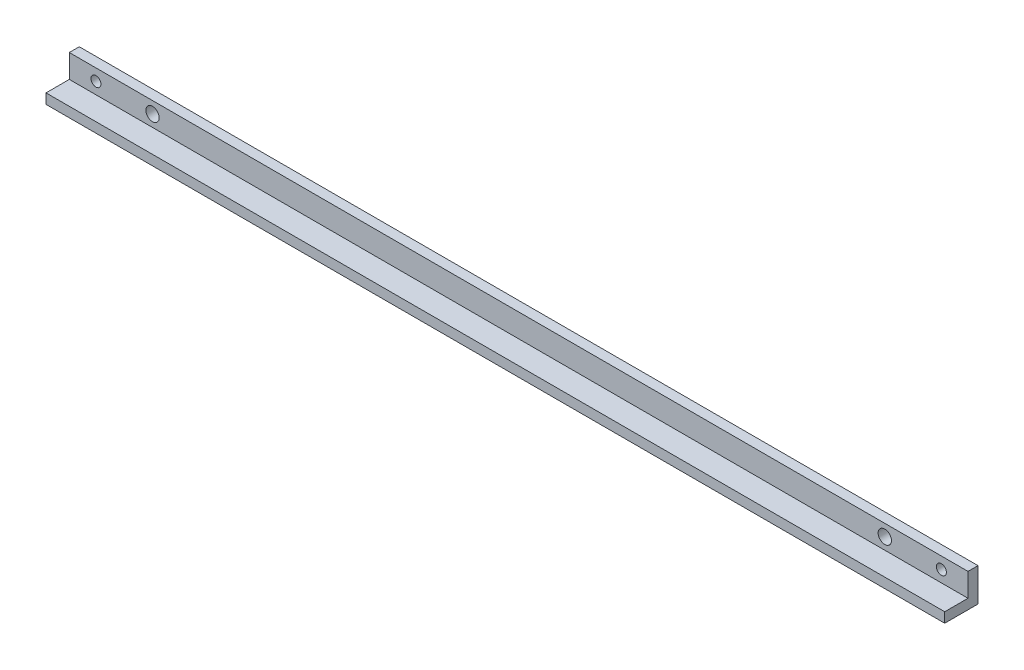
ISO-10303-21;
HEADER;
FILE_DESCRIPTION(('STEP AP214'),'2;1');
FILE_NAME('part.step','',(''),(''),'','','');
FILE_SCHEMA(('AUTOMOTIVE_DESIGN { 1 0 10303 214 1 1 1 1 }'));
ENDSEC;
DATA;
#1=APPLICATION_CONTEXT('core data for automotive mechanical design processes');
#2=APPLICATION_PROTOCOL_DEFINITION('international standard','automotive_design',2000,#1);
#3=PRODUCT_CONTEXT('',#1,'mechanical');
#4=PRODUCT('Part','Part','',(#3));
#5=PRODUCT_RELATED_PRODUCT_CATEGORY('part','',(#4));
#6=PRODUCT_DEFINITION_FORMATION('','',#4);
#7=PRODUCT_DEFINITION_CONTEXT('part definition',#1,'design');
#8=PRODUCT_DEFINITION('design','',#6,#7);
#9=PRODUCT_DEFINITION_SHAPE('','',#8);
#10=(LENGTH_UNIT() NAMED_UNIT(*) SI_UNIT(.MILLI.,.METRE.));
#11=(NAMED_UNIT(*) PLANE_ANGLE_UNIT() SI_UNIT($,.RADIAN.));
#12=(NAMED_UNIT(*) SI_UNIT($,.STERADIAN.) SOLID_ANGLE_UNIT());
#13=UNCERTAINTY_MEASURE_WITH_UNIT(LENGTH_MEASURE(1.E-05),#10,'distance_accuracy_value','');
#14=(GEOMETRIC_REPRESENTATION_CONTEXT(3) GLOBAL_UNCERTAINTY_ASSIGNED_CONTEXT((#13)) GLOBAL_UNIT_ASSIGNED_CONTEXT((#10,
#11,#12)) REPRESENTATION_CONTEXT('',''));
#15=CARTESIAN_POINT('',(0.,0.,0.));
#16=DIRECTION('',(0.,0.,1.));
#17=DIRECTION('',(1.,0.,0.));
#18=AXIS2_PLACEMENT_3D('',#15,#16,#17);
#19=CARTESIAN_POINT('',(270.,10.,0.));
#20=DIRECTION('',(0.,0.,1.));
#21=DIRECTION('',(0.,-1.,0.));
#22=AXIS2_PLACEMENT_3D('',#19,#20,#21);
#23=PLANE('',#22);
#24=CARTESIAN_POINT('',(262.,6.5,0.));
#25=DIRECTION('',(0.,0.,1.));
#26=DIRECTION('',(-1.,0.,0.));
#27=AXIS2_PLACEMENT_3D('',#24,#25,#26);
#28=CIRCLE('',#27,1.50000000000002);
#29=CARTESIAN_POINT('',(260.5,6.5,0.));
#30=VERTEX_POINT('',#29);
#31=EDGE_CURVE('E164',#30,#30,#28,.T.);
#32=ORIENTED_EDGE('',*,*,#31,.T.);
#33=EDGE_LOOP('',(#32));
#34=FACE_BOUND('',#33,.T.);
#35=CARTESIAN_POINT('',(8.,6.5,0.));
#36=DIRECTION('',(0.,0.,1.));
#37=DIRECTION('',(1.,0.,0.));
#38=AXIS2_PLACEMENT_3D('',#35,#36,#37);
#39=CIRCLE('',#38,1.5);
#40=CARTESIAN_POINT('',(9.5,6.5,0.));
#41=VERTEX_POINT('',#40);
#42=EDGE_CURVE('E168',#41,#41,#39,.T.);
#43=ORIENTED_EDGE('',*,*,#42,.T.);
#44=EDGE_LOOP('',(#43));
#45=FACE_BOUND('',#44,.T.);
#46=CARTESIAN_POINT('',(245.,6.50000000000003,0.));
#47=DIRECTION('',(0.,0.,1.));
#48=DIRECTION('',(-1.,0.,0.));
#49=AXIS2_PLACEMENT_3D('',#46,#47,#48);
#50=CIRCLE('',#49,2.00000000000003);
#51=CARTESIAN_POINT('',(243.,6.50000000000003,0.));
#52=VERTEX_POINT('',#51);
#53=EDGE_CURVE('E172',#52,#52,#50,.T.);
#54=ORIENTED_EDGE('',*,*,#53,.T.);
#55=EDGE_LOOP('',(#54));
#56=FACE_BOUND('',#55,.T.);
#57=CARTESIAN_POINT('',(25.,6.5,0.));
#58=DIRECTION('',(0.,0.,1.));
#59=DIRECTION('',(1.,0.,0.));
#60=AXIS2_PLACEMENT_3D('',#57,#58,#59);
#61=CIRCLE('',#60,2.);
#62=CARTESIAN_POINT('',(27.,6.5,0.));
#63=VERTEX_POINT('',#62);
#64=EDGE_CURVE('E123',#63,#63,#61,.T.);
#65=ORIENTED_EDGE('',*,*,#64,.T.);
#66=EDGE_LOOP('',(#65));
#67=FACE_BOUND('',#66,.T.);
#68=DIRECTION('',(0.,1.,0.));
#69=VECTOR('',#68,1.);
#70=CARTESIAN_POINT('',(0.,10.,0.));
#71=LINE('',#70,#69);
#72=CARTESIAN_POINT('',(0.,0.,0.));
#73=VERTEX_POINT('',#72);
#74=CARTESIAN_POINT('',(0.,10.,0.));
#75=VERTEX_POINT('',#74);
#76=EDGE_CURVE('E119',#73,#75,#71,.T.);
#77=ORIENTED_EDGE('',*,*,#76,.T.);
#78=DIRECTION('',(-1.,0.,0.));
#79=VECTOR('',#78,1.);
#80=CARTESIAN_POINT('',(270.,10.,0.));
#81=LINE('',#80,#79);
#82=CARTESIAN_POINT('',(270.,10.,0.));
#83=VERTEX_POINT('',#82);
#84=EDGE_CURVE('E11',#83,#75,#81,.T.);
#85=ORIENTED_EDGE('',*,*,#84,.F.);
#86=DIRECTION('',(0.,1.,0.));
#87=VECTOR('',#86,1.);
#88=CARTESIAN_POINT('',(270.,10.,0.));
#89=LINE('',#88,#87);
#90=CARTESIAN_POINT('',(270.,0.,0.));
#91=VERTEX_POINT('',#90);
#92=EDGE_CURVE('E130',#91,#83,#89,.T.);
#93=ORIENTED_EDGE('',*,*,#92,.F.);
#94=DIRECTION('',(-1.,0.,0.));
#95=VECTOR('',#94,1.);
#96=CARTESIAN_POINT('',(270.,0.,0.));
#97=LINE('',#96,#95);
#98=EDGE_CURVE('E115',#91,#73,#97,.T.);
#99=ORIENTED_EDGE('',*,*,#98,.T.);
#100=EDGE_LOOP('',(#77,#85,#93,#99));
#101=FACE_BOUND('',#100,.T.);
#102=ADVANCED_FACE('F35',(#34,#45,#56,#67,#101),#23,.F.);
#103=CARTESIAN_POINT('',(270.,10.,3.));
#104=DIRECTION('',(0.,-1.,0.));
#105=DIRECTION('',(0.,0.,-1.));
#106=AXIS2_PLACEMENT_3D('',#103,#104,#105);
#107=PLANE('',#106);
#108=DIRECTION('',(0.,0.,1.));
#109=VECTOR('',#108,1.);
#110=CARTESIAN_POINT('',(0.,10.,3.));
#111=LINE('',#110,#109);
#112=CARTESIAN_POINT('',(0.,10.,3.));
#113=VERTEX_POINT('',#112);
#114=EDGE_CURVE('E122',#75,#113,#111,.T.);
#115=ORIENTED_EDGE('',*,*,#114,.T.);
#116=DIRECTION('',(-1.,0.,0.));
#117=VECTOR('',#116,1.);
#118=CARTESIAN_POINT('',(270.,10.,3.));
#119=LINE('',#118,#117);
#120=CARTESIAN_POINT('',(270.,10.,3.));
#121=VERTEX_POINT('',#120);
#122=EDGE_CURVE('E43',#121,#113,#119,.T.);
#123=ORIENTED_EDGE('',*,*,#122,.F.);
#124=DIRECTION('',(0.,0.,1.));
#125=VECTOR('',#124,1.);
#126=CARTESIAN_POINT('',(270.,10.,3.));
#127=LINE('',#126,#125);
#128=EDGE_CURVE('E88',#83,#121,#127,.T.);
#129=ORIENTED_EDGE('',*,*,#128,.F.);
#130=ORIENTED_EDGE('',*,*,#84,.T.);
#131=EDGE_LOOP('',(#115,#123,#129,#130));
#132=FACE_BOUND('',#131,.T.);
#133=ADVANCED_FACE('F154',(#132),#107,.F.);
#134=CARTESIAN_POINT('',(270.,10.,3.));
#135=DIRECTION('',(0.,0.,-1.));
#136=DIRECTION('',(0.,1.,0.));
#137=AXIS2_PLACEMENT_3D('',#134,#135,#136);
#138=PLANE('',#137);
#139=CARTESIAN_POINT('',(262.,6.5,3.));
#140=DIRECTION('',(0.,0.,1.));
#141=DIRECTION('',(-1.,0.,0.));
#142=AXIS2_PLACEMENT_3D('',#139,#140,#141);
#143=CIRCLE('',#142,1.50000000000002);
#144=CARTESIAN_POINT('',(260.5,6.5,3.));
#145=VERTEX_POINT('',#144);
#146=EDGE_CURVE('E191',#145,#145,#143,.T.);
#147=ORIENTED_EDGE('',*,*,#146,.F.);
#148=EDGE_LOOP('',(#147));
#149=FACE_BOUND('',#148,.T.);
#150=CARTESIAN_POINT('',(8.,6.5,3.));
#151=DIRECTION('',(0.,0.,1.));
#152=DIRECTION('',(1.,0.,0.));
#153=AXIS2_PLACEMENT_3D('',#150,#151,#152);
#154=CIRCLE('',#153,1.5);
#155=CARTESIAN_POINT('',(9.5,6.5,3.));
#156=VERTEX_POINT('',#155);
#157=EDGE_CURVE('E187',#156,#156,#154,.T.);
#158=ORIENTED_EDGE('',*,*,#157,.F.);
#159=EDGE_LOOP('',(#158));
#160=FACE_BOUND('',#159,.T.);
#161=CARTESIAN_POINT('',(245.,6.50000000000003,3.));
#162=DIRECTION('',(0.,0.,1.));
#163=DIRECTION('',(-1.,0.,0.));
#164=AXIS2_PLACEMENT_3D('',#161,#162,#163);
#165=CIRCLE('',#164,2.00000000000003);
#166=CARTESIAN_POINT('',(243.,6.50000000000003,3.));
#167=VERTEX_POINT('',#166);
#168=EDGE_CURVE('E181',#167,#167,#165,.T.);
#169=ORIENTED_EDGE('',*,*,#168,.F.);
#170=EDGE_LOOP('',(#169));
#171=FACE_BOUND('',#170,.T.);
#172=CARTESIAN_POINT('',(25.,6.5,3.));
#173=DIRECTION('',(0.,0.,1.));
#174=DIRECTION('',(1.,0.,0.));
#175=AXIS2_PLACEMENT_3D('',#172,#173,#174);
#176=CIRCLE('',#175,2.);
#177=CARTESIAN_POINT('',(27.,6.5,3.));
#178=VERTEX_POINT('',#177);
#179=EDGE_CURVE('E176',#178,#178,#176,.T.);
#180=ORIENTED_EDGE('',*,*,#179,.F.);
#181=EDGE_LOOP('',(#180));
#182=FACE_BOUND('',#181,.T.);
#183=DIRECTION('',(0.,-1.,0.));
#184=VECTOR('',#183,1.);
#185=CARTESIAN_POINT('',(0.,10.,3.));
#186=LINE('',#185,#184);
#187=CARTESIAN_POINT('',(0.,3.,3.));
#188=VERTEX_POINT('',#187);
#189=EDGE_CURVE('E125',#113,#188,#186,.T.);
#190=ORIENTED_EDGE('',*,*,#189,.T.);
#191=DIRECTION('',(-1.,0.,0.));
#192=VECTOR('',#191,1.);
#193=CARTESIAN_POINT('',(270.,3.,3.));
#194=LINE('',#193,#192);
#195=CARTESIAN_POINT('',(270.,3.,3.));
#196=VERTEX_POINT('',#195);
#197=EDGE_CURVE('E110',#196,#188,#194,.T.);
#198=ORIENTED_EDGE('',*,*,#197,.F.);
#199=DIRECTION('',(0.,-1.,0.));
#200=VECTOR('',#199,1.);
#201=CARTESIAN_POINT('',(270.,10.,3.));
#202=LINE('',#201,#200);
#203=EDGE_CURVE('E101',#121,#196,#202,.T.);
#204=ORIENTED_EDGE('',*,*,#203,.F.);
#205=ORIENTED_EDGE('',*,*,#122,.T.);
#206=EDGE_LOOP('',(#190,#198,#204,#205));
#207=FACE_BOUND('',#206,.T.);
#208=ADVANCED_FACE('F136',(#149,#160,#171,#182,#207),#138,.F.);
#209=CARTESIAN_POINT('',(270.,3.,10.));
#210=DIRECTION('',(0.,-1.,0.));
#211=DIRECTION('',(0.,0.,-1.));
#212=AXIS2_PLACEMENT_3D('',#209,#210,#211);
#213=PLANE('',#212);
#214=DIRECTION('',(0.,0.,1.));
#215=VECTOR('',#214,1.);
#216=CARTESIAN_POINT('',(0.,3.,10.));
#217=LINE('',#216,#215);
#218=CARTESIAN_POINT('',(0.,3.,10.));
#219=VERTEX_POINT('',#218);
#220=EDGE_CURVE('E109',#188,#219,#217,.T.);
#221=ORIENTED_EDGE('',*,*,#220,.T.);
#222=DIRECTION('',(-1.,0.,0.));
#223=VECTOR('',#222,1.);
#224=CARTESIAN_POINT('',(270.,3.,10.));
#225=LINE('',#224,#223);
#226=CARTESIAN_POINT('',(270.,3.,10.));
#227=VERTEX_POINT('',#226);
#228=EDGE_CURVE('E106',#227,#219,#225,.T.);
#229=ORIENTED_EDGE('',*,*,#228,.F.);
#230=DIRECTION('',(0.,0.,1.));
#231=VECTOR('',#230,1.);
#232=CARTESIAN_POINT('',(270.,3.,10.));
#233=LINE('',#232,#231);
#234=EDGE_CURVE('E95',#196,#227,#233,.T.);
#235=ORIENTED_EDGE('',*,*,#234,.F.);
#236=ORIENTED_EDGE('',*,*,#197,.T.);
#237=EDGE_LOOP('',(#221,#229,#235,#236));
#238=FACE_BOUND('',#237,.T.);
#239=ADVANCED_FACE('F107',(#238),#213,.F.);
#240=CARTESIAN_POINT('',(270.,0.,10.));
#241=DIRECTION('',(0.,0.,-1.));
#242=DIRECTION('',(-1.,0.,0.));
#243=AXIS2_PLACEMENT_3D('',#240,#241,#242);
#244=PLANE('',#243);
#245=DIRECTION('',(0.,-1.,0.));
#246=VECTOR('',#245,1.);
#247=CARTESIAN_POINT('',(0.,0.,10.));
#248=LINE('',#247,#246);
#249=CARTESIAN_POINT('',(0.,0.,10.));
#250=VERTEX_POINT('',#249);
#251=EDGE_CURVE('E74',#219,#250,#248,.T.);
#252=ORIENTED_EDGE('',*,*,#251,.T.);
#253=DIRECTION('',(-1.,0.,0.));
#254=VECTOR('',#253,1.);
#255=CARTESIAN_POINT('',(270.,0.,10.));
#256=LINE('',#255,#254);
#257=CARTESIAN_POINT('',(270.,0.,10.));
#258=VERTEX_POINT('',#257);
#259=EDGE_CURVE('E111',#258,#250,#256,.T.);
#260=ORIENTED_EDGE('',*,*,#259,.F.);
#261=DIRECTION('',(0.,-1.,0.));
#262=VECTOR('',#261,1.);
#263=CARTESIAN_POINT('',(270.,0.,10.));
#264=LINE('',#263,#262);
#265=EDGE_CURVE('E99',#227,#258,#264,.T.);
#266=ORIENTED_EDGE('',*,*,#265,.F.);
#267=ORIENTED_EDGE('',*,*,#228,.T.);
#268=EDGE_LOOP('',(#252,#260,#266,#267));
#269=FACE_BOUND('',#268,.T.);
#270=ADVANCED_FACE('F113',(#269),#244,.F.);
#271=CARTESIAN_POINT('',(270.,0.,0.));
#272=DIRECTION('',(0.,1.,0.));
#273=DIRECTION('',(0.,0.,1.));
#274=AXIS2_PLACEMENT_3D('',#271,#272,#273);
#275=PLANE('',#274);
#276=DIRECTION('',(0.,0.,-1.));
#277=VECTOR('',#276,1.);
#278=CARTESIAN_POINT('',(0.,0.,0.));
#279=LINE('',#278,#277);
#280=EDGE_CURVE('E80',#250,#73,#279,.T.);
#281=ORIENTED_EDGE('',*,*,#280,.T.);
#282=ORIENTED_EDGE('',*,*,#98,.F.);
#283=DIRECTION('',(0.,0.,-1.));
#284=VECTOR('',#283,1.);
#285=CARTESIAN_POINT('',(270.,0.,0.));
#286=LINE('',#285,#284);
#287=EDGE_CURVE('E51',#258,#91,#286,.T.);
#288=ORIENTED_EDGE('',*,*,#287,.F.);
#289=ORIENTED_EDGE('',*,*,#259,.T.);
#290=EDGE_LOOP('',(#281,#282,#288,#289));
#291=FACE_BOUND('',#290,.T.);
#292=ADVANCED_FACE('F143',(#291),#275,.F.);
#293=CARTESIAN_POINT('',(270.,0.,0.));
#294=DIRECTION('',(-1.,0.,0.));
#295=DIRECTION('',(0.,0.,1.));
#296=AXIS2_PLACEMENT_3D('',#293,#294,#295);
#297=PLANE('',#296);
#298=ORIENTED_EDGE('',*,*,#92,.T.);
#299=ORIENTED_EDGE('',*,*,#128,.T.);
#300=ORIENTED_EDGE('',*,*,#203,.T.);
#301=ORIENTED_EDGE('',*,*,#234,.T.);
#302=ORIENTED_EDGE('',*,*,#265,.T.);
#303=ORIENTED_EDGE('',*,*,#287,.T.);
#304=EDGE_LOOP('',(#298,#299,#300,#301,#302,#303));
#305=FACE_BOUND('',#304,.T.);
#306=ADVANCED_FACE('F97',(#305),#297,.F.);
#307=CARTESIAN_POINT('',(0.,0.,0.));
#308=DIRECTION('',(-1.,0.,0.));
#309=DIRECTION('',(0.,0.,1.));
#310=AXIS2_PLACEMENT_3D('',#307,#308,#309);
#311=PLANE('',#310);
#312=ORIENTED_EDGE('',*,*,#76,.F.);
#313=ORIENTED_EDGE('',*,*,#280,.F.);
#314=ORIENTED_EDGE('',*,*,#251,.F.);
#315=ORIENTED_EDGE('',*,*,#220,.F.);
#316=ORIENTED_EDGE('',*,*,#189,.F.);
#317=ORIENTED_EDGE('',*,*,#114,.F.);
#318=EDGE_LOOP('',(#312,#313,#314,#315,#316,#317));
#319=FACE_BOUND('',#318,.T.);
#320=ADVANCED_FACE('F139',(#319),#311,.T.);
#321=CARTESIAN_POINT('',(25.,6.5,0.));
#322=DIRECTION('',(0.,0.,1.));
#323=DIRECTION('',(1.,0.,0.));
#324=AXIS2_PLACEMENT_3D('',#321,#322,#323);
#325=CYLINDRICAL_SURFACE('',#324,2.);
#326=ORIENTED_EDGE('',*,*,#64,.F.);
#327=EDGE_LOOP('',(#326));
#328=FACE_BOUND('',#327,.T.);
#329=ORIENTED_EDGE('',*,*,#179,.T.);
#330=EDGE_LOOP('',(#329));
#331=FACE_BOUND('',#330,.T.);
#332=ADVANCED_FACE('F206',(#328,#331),#325,.F.);
#333=CARTESIAN_POINT('',(245.,6.50000000000003,0.));
#334=DIRECTION('',(0.,0.,1.));
#335=DIRECTION('',(1.,0.,0.));
#336=AXIS2_PLACEMENT_3D('',#333,#334,#335);
#337=CYLINDRICAL_SURFACE('',#336,2.00000000000003);
#338=ORIENTED_EDGE('',*,*,#53,.F.);
#339=EDGE_LOOP('',(#338));
#340=FACE_BOUND('',#339,.T.);
#341=ORIENTED_EDGE('',*,*,#168,.T.);
#342=EDGE_LOOP('',(#341));
#343=FACE_BOUND('',#342,.T.);
#344=ADVANCED_FACE('F208',(#340,#343),#337,.F.);
#345=CARTESIAN_POINT('',(8.,6.5,0.));
#346=DIRECTION('',(0.,0.,1.));
#347=DIRECTION('',(1.,0.,0.));
#348=AXIS2_PLACEMENT_3D('',#345,#346,#347);
#349=CYLINDRICAL_SURFACE('',#348,1.5);
#350=ORIENTED_EDGE('',*,*,#42,.F.);
#351=EDGE_LOOP('',(#350));
#352=FACE_BOUND('',#351,.T.);
#353=ORIENTED_EDGE('',*,*,#157,.T.);
#354=EDGE_LOOP('',(#353));
#355=FACE_BOUND('',#354,.T.);
#356=ADVANCED_FACE('F214',(#352,#355),#349,.F.);
#357=CARTESIAN_POINT('',(262.,6.5,0.));
#358=DIRECTION('',(0.,0.,1.));
#359=DIRECTION('',(1.,0.,0.));
#360=AXIS2_PLACEMENT_3D('',#357,#358,#359);
#361=CYLINDRICAL_SURFACE('',#360,1.50000000000002);
#362=ORIENTED_EDGE('',*,*,#31,.F.);
#363=EDGE_LOOP('',(#362));
#364=FACE_BOUND('',#363,.T.);
#365=ORIENTED_EDGE('',*,*,#146,.T.);
#366=EDGE_LOOP('',(#365));
#367=FACE_BOUND('',#366,.T.);
#368=ADVANCED_FACE('F196',(#364,#367),#361,.F.);
#369=CLOSED_SHELL('',(#102,#133,#208,#239,#270,#292,#306,#320,#332,#344,#356,#368));
#370=MANIFOLD_SOLID_BREP('B2',#369);
#371=ADVANCED_BREP_SHAPE_REPRESENTATION('',(#18,#370),#14);
#372=SHAPE_DEFINITION_REPRESENTATION(#9,#371);
ENDSEC;
END-ISO-10303-21;
